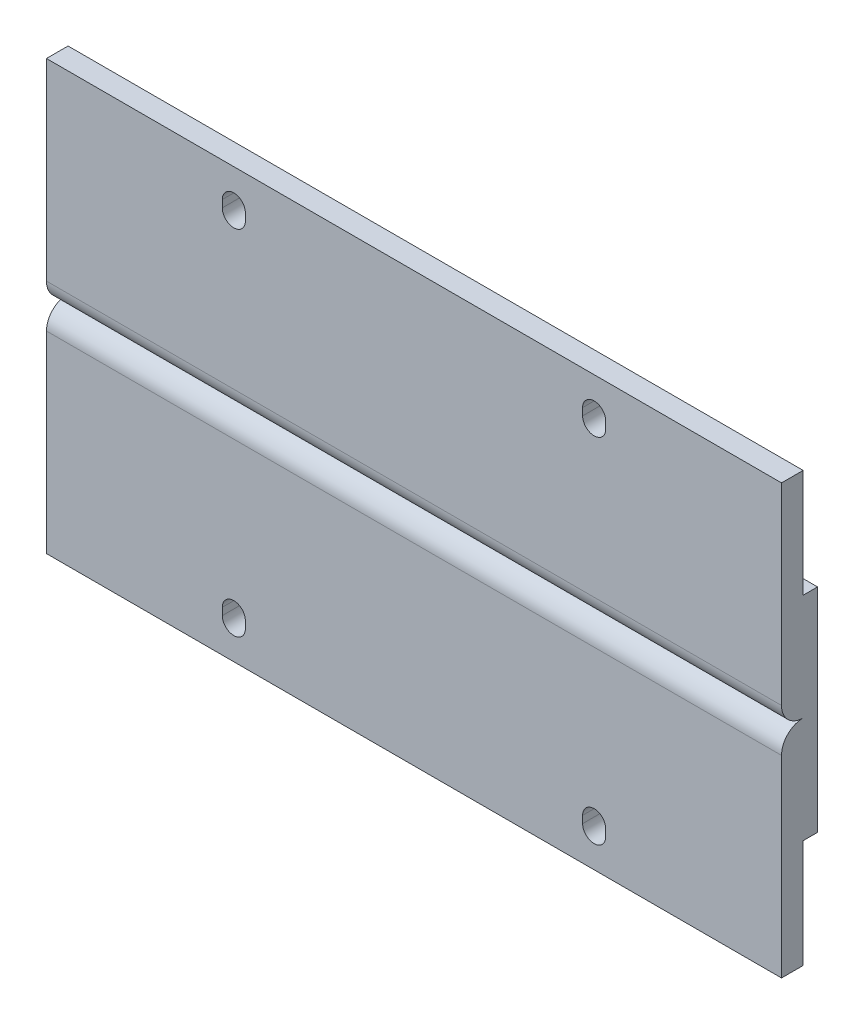
ISO-10303-21;
HEADER;
FILE_DESCRIPTION(('STEP AP214'),'2;1');
FILE_NAME('part.step','',(''),(''),'','','');
FILE_SCHEMA(('AUTOMOTIVE_DESIGN { 1 0 10303 214 1 1 1 1 }'));
ENDSEC;
DATA;
#1=APPLICATION_CONTEXT('core data for automotive mechanical design processes');
#2=APPLICATION_PROTOCOL_DEFINITION('international standard','automotive_design',2000,#1);
#3=PRODUCT_CONTEXT('',#1,'mechanical');
#4=PRODUCT('Part','Part','',(#3));
#5=PRODUCT_RELATED_PRODUCT_CATEGORY('part','',(#4));
#6=PRODUCT_DEFINITION_FORMATION('','',#4);
#7=PRODUCT_DEFINITION_CONTEXT('part definition',#1,'design');
#8=PRODUCT_DEFINITION('design','',#6,#7);
#9=PRODUCT_DEFINITION_SHAPE('','',#8);
#10=(LENGTH_UNIT() NAMED_UNIT(*) SI_UNIT(.MILLI.,.METRE.));
#11=(NAMED_UNIT(*) PLANE_ANGLE_UNIT() SI_UNIT($,.RADIAN.));
#12=(NAMED_UNIT(*) SI_UNIT($,.STERADIAN.) SOLID_ANGLE_UNIT());
#13=UNCERTAINTY_MEASURE_WITH_UNIT(LENGTH_MEASURE(1.E-05),#10,'distance_accuracy_value','');
#14=(GEOMETRIC_REPRESENTATION_CONTEXT(3) GLOBAL_UNCERTAINTY_ASSIGNED_CONTEXT((#13)) GLOBAL_UNIT_ASSIGNED_CONTEXT((#10,
#11,#12)) REPRESENTATION_CONTEXT('',''));
#15=CARTESIAN_POINT('',(0.,0.,0.));
#16=DIRECTION('',(0.,0.,1.));
#17=DIRECTION('',(1.,0.,0.));
#18=AXIS2_PLACEMENT_3D('',#15,#16,#17);
#19=CARTESIAN_POINT('',(51.,29.75,0.));
#20=DIRECTION('',(0.,0.,-1.));
#21=DIRECTION('',(-1.,0.,0.));
#22=AXIS2_PLACEMENT_3D('',#19,#20,#21);
#23=PLANE('',#22);
#24=DIRECTION('',(0.,1.,0.));
#25=VECTOR('',#24,1.);
#26=CARTESIAN_POINT('',(26.6,24.,0.));
#27=LINE('',#26,#25);
#28=CARTESIAN_POINT('',(26.6,24.,0.));
#29=VERTEX_POINT('',#28);
#30=CARTESIAN_POINT('',(26.6,25.,0.));
#31=VERTEX_POINT('',#30);
#32=EDGE_CURVE('E435',#29,#31,#27,.T.);
#33=ORIENTED_EDGE('',*,*,#32,.F.);
#34=CARTESIAN_POINT('',(25.,24.,0.));
#35=DIRECTION('',(0.,0.,1.));
#36=DIRECTION('',(1.,0.,0.));
#37=AXIS2_PLACEMENT_3D('',#34,#35,#36);
#38=CIRCLE('',#37,1.6);
#39=CARTESIAN_POINT('',(23.4,24.,0.));
#40=VERTEX_POINT('',#39);
#41=EDGE_CURVE('E432',#40,#29,#38,.T.);
#42=ORIENTED_EDGE('',*,*,#41,.F.);
#43=DIRECTION('',(0.,-1.,0.));
#44=VECTOR('',#43,1.);
#45=CARTESIAN_POINT('',(23.4,24.,0.));
#46=LINE('',#45,#44);
#47=CARTESIAN_POINT('',(23.4,25.,0.));
#48=VERTEX_POINT('',#47);
#49=EDGE_CURVE('E443',#48,#40,#46,.T.);
#50=ORIENTED_EDGE('',*,*,#49,.F.);
#51=CARTESIAN_POINT('',(25.,25.,0.));
#52=DIRECTION('',(0.,0.,1.));
#53=DIRECTION('',(1.,0.,0.));
#54=AXIS2_PLACEMENT_3D('',#51,#52,#53);
#55=CIRCLE('',#54,1.6);
#56=EDGE_CURVE('E439',#31,#48,#55,.T.);
#57=ORIENTED_EDGE('',*,*,#56,.F.);
#58=EDGE_LOOP('',(#33,#42,#50,#57));
#59=FACE_BOUND('',#58,.T.);
#60=DIRECTION('',(0.,1.,0.));
#61=VECTOR('',#60,1.);
#62=CARTESIAN_POINT('',(-23.4,24.,0.));
#63=LINE('',#62,#61);
#64=CARTESIAN_POINT('',(-23.4,24.,0.));
#65=VERTEX_POINT('',#64);
#66=CARTESIAN_POINT('',(-23.4,25.,0.));
#67=VERTEX_POINT('',#66);
#68=EDGE_CURVE('E544',#65,#67,#63,.T.);
#69=ORIENTED_EDGE('',*,*,#68,.F.);
#70=CARTESIAN_POINT('',(-25.,24.,0.));
#71=DIRECTION('',(0.,0.,1.));
#72=DIRECTION('',(1.,0.,0.));
#73=AXIS2_PLACEMENT_3D('',#70,#71,#72);
#74=CIRCLE('',#73,1.6);
#75=CARTESIAN_POINT('',(-26.6,24.,0.));
#76=VERTEX_POINT('',#75);
#77=EDGE_CURVE('E68',#76,#65,#74,.T.);
#78=ORIENTED_EDGE('',*,*,#77,.F.);
#79=DIRECTION('',(0.,-1.,0.));
#80=VECTOR('',#79,1.);
#81=CARTESIAN_POINT('',(-26.6,24.,0.));
#82=LINE('',#81,#80);
#83=CARTESIAN_POINT('',(-26.6,25.,0.));
#84=VERTEX_POINT('',#83);
#85=EDGE_CURVE('E528',#84,#76,#82,.T.);
#86=ORIENTED_EDGE('',*,*,#85,.F.);
#87=CARTESIAN_POINT('',(-25.,25.,0.));
#88=DIRECTION('',(0.,0.,1.));
#89=DIRECTION('',(1.,0.,0.));
#90=AXIS2_PLACEMENT_3D('',#87,#88,#89);
#91=CIRCLE('',#90,1.6);
#92=EDGE_CURVE('E540',#67,#84,#91,.T.);
#93=ORIENTED_EDGE('',*,*,#92,.F.);
#94=EDGE_LOOP('',(#69,#78,#86,#93));
#95=FACE_BOUND('',#94,.T.);
#96=DIRECTION('',(0.,-1.,0.));
#97=VECTOR('',#96,1.);
#98=CARTESIAN_POINT('',(-51.,29.75,0.));
#99=LINE('',#98,#97);
#100=CARTESIAN_POINT('',(-51.,29.75,0.));
#101=VERTEX_POINT('',#100);
#102=CARTESIAN_POINT('',(-51.,3.,0.));
#103=VERTEX_POINT('',#102);
#104=EDGE_CURVE('E284',#101,#103,#99,.T.);
#105=ORIENTED_EDGE('',*,*,#104,.T.);
#106=DIRECTION('',(1.,0.,0.));
#107=VECTOR('',#106,1.);
#108=CARTESIAN_POINT('',(-51.,3.,0.));
#109=LINE('',#108,#107);
#110=CARTESIAN_POINT('',(51.,3.,0.));
#111=VERTEX_POINT('',#110);
#112=EDGE_CURVE('E877',#103,#111,#109,.T.);
#113=ORIENTED_EDGE('',*,*,#112,.T.);
#114=DIRECTION('',(0.,-1.,0.));
#115=VECTOR('',#114,1.);
#116=CARTESIAN_POINT('',(51.,29.75,0.));
#117=LINE('',#116,#115);
#118=CARTESIAN_POINT('',(51.,29.75,0.));
#119=VERTEX_POINT('',#118);
#120=EDGE_CURVE('E249',#119,#111,#117,.T.);
#121=ORIENTED_EDGE('',*,*,#120,.F.);
#122=DIRECTION('',(-1.,0.,0.));
#123=VECTOR('',#122,1.);
#124=CARTESIAN_POINT('',(51.,29.75,0.));
#125=LINE('',#124,#123);
#126=EDGE_CURVE('E330',#119,#101,#125,.T.);
#127=ORIENTED_EDGE('',*,*,#126,.T.);
#128=EDGE_LOOP('',(#105,#113,#121,#127));
#129=FACE_BOUND('',#128,.T.);
#130=ADVANCED_FACE('F44',(#59,#95,#129),#23,.F.);
#131=CARTESIAN_POINT('',(51.,29.75,-2.99999999999998));
#132=DIRECTION('',(0.,-1.,0.));
#133=DIRECTION('',(0.,0.,-1.));
#134=AXIS2_PLACEMENT_3D('',#131,#132,#133);
#135=PLANE('',#134);
#136=DIRECTION('',(0.,0.,1.));
#137=VECTOR('',#136,1.);
#138=CARTESIAN_POINT('',(-51.,29.75,-2.99999999999998));
#139=LINE('',#138,#137);
#140=CARTESIAN_POINT('',(-51.,29.75,-2.99999999999998));
#141=VERTEX_POINT('',#140);
#142=EDGE_CURVE('E278',#141,#101,#139,.T.);
#143=ORIENTED_EDGE('',*,*,#142,.T.);
#144=ORIENTED_EDGE('',*,*,#126,.F.);
#145=DIRECTION('',(0.,0.,1.));
#146=VECTOR('',#145,1.);
#147=CARTESIAN_POINT('',(51.,29.75,-2.99999999999998));
#148=LINE('',#147,#146);
#149=CARTESIAN_POINT('',(51.,29.75,-2.99999999999998));
#150=VERTEX_POINT('',#149);
#151=EDGE_CURVE('E250',#150,#119,#148,.T.);
#152=ORIENTED_EDGE('',*,*,#151,.F.);
#153=DIRECTION('',(-1.,0.,0.));
#154=VECTOR('',#153,1.);
#155=CARTESIAN_POINT('',(51.,29.75,-2.99999999999998));
#156=LINE('',#155,#154);
#157=EDGE_CURVE('E277',#150,#141,#156,.T.);
#158=ORIENTED_EDGE('',*,*,#157,.T.);
#159=EDGE_LOOP('',(#143,#144,#152,#158));
#160=FACE_BOUND('',#159,.T.);
#161=ADVANCED_FACE('F46',(#160),#135,.F.);
#162=DIRECTION('',(0.,-1.,0.));
#163=VECTOR('',#162,1.);
#164=CARTESIAN_POINT('',(23.4,-24.,0.));
#165=LINE('',#164,#163);
#166=CARTESIAN_POINT('',(23.4,-24.,0.));
#167=VERTEX_POINT('',#166);
#168=CARTESIAN_POINT('',(23.4,-25.,0.));
#169=VERTEX_POINT('',#168);
#170=EDGE_CURVE('E424',#167,#169,#165,.T.);
#171=ORIENTED_EDGE('',*,*,#170,.F.);
#172=CARTESIAN_POINT('',(25.,-24.,0.));
#173=DIRECTION('',(0.,0.,1.));
#174=DIRECTION('',(1.,0.,0.));
#175=AXIS2_PLACEMENT_3D('',#172,#173,#174);
#176=CIRCLE('',#175,1.6);
#177=CARTESIAN_POINT('',(26.6,-24.,0.));
#178=VERTEX_POINT('',#177);
#179=EDGE_CURVE('E428',#178,#167,#176,.T.);
#180=ORIENTED_EDGE('',*,*,#179,.F.);
#181=DIRECTION('',(0.,1.,0.));
#182=VECTOR('',#181,1.);
#183=CARTESIAN_POINT('',(26.6,-24.,0.));
#184=LINE('',#183,#182);
#185=CARTESIAN_POINT('',(26.6,-25.,0.));
#186=VERTEX_POINT('',#185);
#187=EDGE_CURVE('E419',#186,#178,#184,.T.);
#188=ORIENTED_EDGE('',*,*,#187,.F.);
#189=CARTESIAN_POINT('',(25.,-25.,0.));
#190=DIRECTION('',(0.,0.,1.));
#191=DIRECTION('',(1.,0.,0.));
#192=AXIS2_PLACEMENT_3D('',#189,#190,#191);
#193=CIRCLE('',#192,1.59999999999999);
#194=EDGE_CURVE('E406',#169,#186,#193,.T.);
#195=ORIENTED_EDGE('',*,*,#194,.F.);
#196=EDGE_LOOP('',(#171,#180,#188,#195));
#197=FACE_BOUND('',#196,.T.);
#198=DIRECTION('',(0.,-1.,0.));
#199=VECTOR('',#198,1.);
#200=CARTESIAN_POINT('',(-26.6,-24.,0.));
#201=LINE('',#200,#199);
#202=CARTESIAN_POINT('',(-26.6,-24.,0.));
#203=VERTEX_POINT('',#202);
#204=CARTESIAN_POINT('',(-26.6,-25.,0.));
#205=VERTEX_POINT('',#204);
#206=EDGE_CURVE('E510',#203,#205,#201,.T.);
#207=ORIENTED_EDGE('',*,*,#206,.F.);
#208=CARTESIAN_POINT('',(-25.,-24.,0.));
#209=DIRECTION('',(0.,0.,1.));
#210=DIRECTION('',(1.,0.,0.));
#211=AXIS2_PLACEMENT_3D('',#208,#209,#210);
#212=CIRCLE('',#211,1.6);
#213=CARTESIAN_POINT('',(-23.4,-24.,0.));
#214=VERTEX_POINT('',#213);
#215=EDGE_CURVE('E415',#214,#203,#212,.T.);
#216=ORIENTED_EDGE('',*,*,#215,.F.);
#217=DIRECTION('',(0.,1.,0.));
#218=VECTOR('',#217,1.);
#219=CARTESIAN_POINT('',(-23.4,-24.,0.));
#220=LINE('',#219,#218);
#221=CARTESIAN_POINT('',(-23.4,-25.,0.));
#222=VERTEX_POINT('',#221);
#223=EDGE_CURVE('E521',#222,#214,#220,.T.);
#224=ORIENTED_EDGE('',*,*,#223,.F.);
#225=CARTESIAN_POINT('',(-25.,-25.,0.));
#226=DIRECTION('',(0.,0.,1.));
#227=DIRECTION('',(1.,0.,0.));
#228=AXIS2_PLACEMENT_3D('',#225,#226,#227);
#229=CIRCLE('',#228,1.59999999999999);
#230=EDGE_CURVE('E513',#205,#222,#229,.T.);
#231=ORIENTED_EDGE('',*,*,#230,.F.);
#232=EDGE_LOOP('',(#207,#216,#224,#231));
#233=FACE_BOUND('',#232,.T.);
#234=CARTESIAN_POINT('',(51.,-3.,0.));
#235=VERTEX_POINT('',#234);
#236=CARTESIAN_POINT('',(51.,-29.75,0.));
#237=VERTEX_POINT('',#236);
#238=EDGE_CURVE('E239',#235,#237,#117,.T.);
#239=ORIENTED_EDGE('',*,*,#238,.F.);
#240=DIRECTION('',(1.,0.,0.));
#241=VECTOR('',#240,1.);
#242=CARTESIAN_POINT('',(-51.,-3.,0.));
#243=LINE('',#242,#241);
#244=CARTESIAN_POINT('',(-51.,-3.,0.));
#245=VERTEX_POINT('',#244);
#246=EDGE_CURVE('E223',#245,#235,#243,.T.);
#247=ORIENTED_EDGE('',*,*,#246,.F.);
#248=CARTESIAN_POINT('',(-51.,-29.75,0.));
#249=VERTEX_POINT('',#248);
#250=EDGE_CURVE('E282',#245,#249,#99,.T.);
#251=ORIENTED_EDGE('',*,*,#250,.T.);
#252=DIRECTION('',(-1.,0.,0.));
#253=VECTOR('',#252,1.);
#254=CARTESIAN_POINT('',(51.,-29.75,0.));
#255=LINE('',#254,#253);
#256=EDGE_CURVE('E246',#237,#249,#255,.T.);
#257=ORIENTED_EDGE('',*,*,#256,.F.);
#258=EDGE_LOOP('',(#239,#247,#251,#257));
#259=FACE_BOUND('',#258,.T.);
#260=ADVANCED_FACE('F244',(#197,#233,#259),#23,.F.);
#261=CARTESIAN_POINT('',(51.,-29.75,0.));
#262=DIRECTION('',(0.,1.,0.));
#263=DIRECTION('',(0.,0.,1.));
#264=AXIS2_PLACEMENT_3D('',#261,#262,#263);
#265=PLANE('',#264);
#266=DIRECTION('',(0.,0.,-1.));
#267=VECTOR('',#266,1.);
#268=CARTESIAN_POINT('',(-51.,-29.75,0.));
#269=LINE('',#268,#267);
#270=CARTESIAN_POINT('',(-51.,-29.75,-2.99999999999998));
#271=VERTEX_POINT('',#270);
#272=EDGE_CURVE('E288',#249,#271,#269,.T.);
#273=ORIENTED_EDGE('',*,*,#272,.T.);
#274=DIRECTION('',(-1.,0.,0.));
#275=VECTOR('',#274,1.);
#276=CARTESIAN_POINT('',(51.,-29.75,-2.99999999999998));
#277=LINE('',#276,#275);
#278=CARTESIAN_POINT('',(51.,-29.75,-2.99999999999998));
#279=VERTEX_POINT('',#278);
#280=EDGE_CURVE('E324',#279,#271,#277,.T.);
#281=ORIENTED_EDGE('',*,*,#280,.F.);
#282=DIRECTION('',(0.,0.,-1.));
#283=VECTOR('',#282,1.);
#284=CARTESIAN_POINT('',(51.,-29.75,0.));
#285=LINE('',#284,#283);
#286=EDGE_CURVE('E254',#237,#279,#285,.T.);
#287=ORIENTED_EDGE('',*,*,#286,.F.);
#288=ORIENTED_EDGE('',*,*,#256,.T.);
#289=EDGE_LOOP('',(#273,#281,#287,#288));
#290=FACE_BOUND('',#289,.T.);
#291=ADVANCED_FACE('F496',(#290),#265,.F.);
#292=CARTESIAN_POINT('',(51.,-29.75,-2.99999999999998));
#293=DIRECTION('',(0.,0.,1.));
#294=DIRECTION('',(0.,-1.,0.));
#295=AXIS2_PLACEMENT_3D('',#292,#293,#294);
#296=PLANE('',#295);
#297=DIRECTION('',(0.,1.,0.));
#298=VECTOR('',#297,1.);
#299=CARTESIAN_POINT('',(26.6,-29.7499999999999,-2.99999999999998));
#300=LINE('',#299,#298);
#301=CARTESIAN_POINT('',(26.6,-25.,-2.99999999999999));
#302=VERTEX_POINT('',#301);
#303=CARTESIAN_POINT('',(26.6,-24.,-2.99999999999999));
#304=VERTEX_POINT('',#303);
#305=EDGE_CURVE('E53',#302,#304,#300,.T.);
#306=ORIENTED_EDGE('',*,*,#305,.T.);
#307=CARTESIAN_POINT('',(25.,-24.,-2.99999999999999));
#308=DIRECTION('',(0.,0.,1.));
#309=DIRECTION('',(0.,-1.,0.));
#310=AXIS2_PLACEMENT_3D('',#307,#308,#309);
#311=CIRCLE('',#310,1.6);
#312=CARTESIAN_POINT('',(23.4,-24.,-2.99999999999999));
#313=VERTEX_POINT('',#312);
#314=EDGE_CURVE('E11',#304,#313,#311,.T.);
#315=ORIENTED_EDGE('',*,*,#314,.T.);
#316=DIRECTION('',(0.,-1.,0.));
#317=VECTOR('',#316,1.);
#318=CARTESIAN_POINT('',(23.4,-29.7500000000001,-2.99999999999998));
#319=LINE('',#318,#317);
#320=CARTESIAN_POINT('',(23.4,-25.,-2.99999999999999));
#321=VERTEX_POINT('',#320);
#322=EDGE_CURVE('E382',#313,#321,#319,.T.);
#323=ORIENTED_EDGE('',*,*,#322,.T.);
#324=CARTESIAN_POINT('',(25.,-25.,-2.99999999999999));
#325=DIRECTION('',(0.,0.,1.));
#326=DIRECTION('',(0.,-1.,0.));
#327=AXIS2_PLACEMENT_3D('',#324,#325,#326);
#328=CIRCLE('',#327,1.59999999999999);
#329=EDGE_CURVE('E386',#321,#302,#328,.T.);
#330=ORIENTED_EDGE('',*,*,#329,.T.);
#331=EDGE_LOOP('',(#306,#315,#323,#330));
#332=FACE_BOUND('',#331,.T.);
#333=DIRECTION('',(0.,1.,0.));
#334=VECTOR('',#333,1.);
#335=CARTESIAN_POINT('',(-23.4,-29.7499999999997,-2.99999999999998));
#336=LINE('',#335,#334);
#337=CARTESIAN_POINT('',(-23.4,-25.,-2.99999999999999));
#338=VERTEX_POINT('',#337);
#339=CARTESIAN_POINT('',(-23.4,-24.,-2.99999999999999));
#340=VERTEX_POINT('',#339);
#341=EDGE_CURVE('E374',#338,#340,#336,.T.);
#342=ORIENTED_EDGE('',*,*,#341,.T.);
#343=CARTESIAN_POINT('',(-25.,-24.,-2.99999999999999));
#344=DIRECTION('',(0.,0.,1.));
#345=DIRECTION('',(0.,-1.,0.));
#346=AXIS2_PLACEMENT_3D('',#343,#344,#345);
#347=CIRCLE('',#346,1.6);
#348=CARTESIAN_POINT('',(-26.6,-24.,-2.99999999999999));
#349=VERTEX_POINT('',#348);
#350=EDGE_CURVE('E378',#340,#349,#347,.T.);
#351=ORIENTED_EDGE('',*,*,#350,.T.);
#352=DIRECTION('',(0.,-1.,0.));
#353=VECTOR('',#352,1.);
#354=CARTESIAN_POINT('',(-26.6,-29.7500000000003,-2.99999999999998));
#355=LINE('',#354,#353);
#356=CARTESIAN_POINT('',(-26.6,-25.,-2.99999999999999));
#357=VERTEX_POINT('',#356);
#358=EDGE_CURVE('E366',#349,#357,#355,.T.);
#359=ORIENTED_EDGE('',*,*,#358,.T.);
#360=CARTESIAN_POINT('',(-25.,-25.,-2.99999999999999));
#361=DIRECTION('',(0.,0.,1.));
#362=DIRECTION('',(0.,-1.,0.));
#363=AXIS2_PLACEMENT_3D('',#360,#361,#362);
#364=CIRCLE('',#363,1.59999999999999);
#365=EDGE_CURVE('E370',#357,#338,#364,.T.);
#366=ORIENTED_EDGE('',*,*,#365,.T.);
#367=EDGE_LOOP('',(#342,#351,#359,#366));
#368=FACE_BOUND('',#367,.T.);
#369=DIRECTION('',(0.,1.,0.));
#370=VECTOR('',#369,1.);
#371=CARTESIAN_POINT('',(-51.,-29.75,-2.99999999999998));
#372=LINE('',#371,#370);
#373=CARTESIAN_POINT('',(-51.,-14.75,-3.00000000000001));
#374=VERTEX_POINT('',#373);
#375=EDGE_CURVE('E291',#271,#374,#372,.T.);
#376=ORIENTED_EDGE('',*,*,#375,.T.);
#377=DIRECTION('',(-1.,0.,0.));
#378=VECTOR('',#377,1.);
#379=CARTESIAN_POINT('',(51.,-14.75,-3.00000000000001));
#380=LINE('',#379,#378);
#381=CARTESIAN_POINT('',(51.,-14.75,-3.00000000000001));
#382=VERTEX_POINT('',#381);
#383=EDGE_CURVE('E320',#382,#374,#380,.T.);
#384=ORIENTED_EDGE('',*,*,#383,.F.);
#385=DIRECTION('',(0.,1.,0.));
#386=VECTOR('',#385,1.);
#387=CARTESIAN_POINT('',(51.,-29.75,-2.99999999999998));
#388=LINE('',#387,#386);
#389=EDGE_CURVE('E262',#279,#382,#388,.T.);
#390=ORIENTED_EDGE('',*,*,#389,.F.);
#391=ORIENTED_EDGE('',*,*,#280,.T.);
#392=EDGE_LOOP('',(#376,#384,#390,#391));
#393=FACE_BOUND('',#392,.T.);
#394=ADVANCED_FACE('F392',(#332,#368,#393),#296,.F.);
#395=CARTESIAN_POINT('',(51.,-14.75,-3.00000000000001));
#396=DIRECTION('',(0.,1.,0.));
#397=DIRECTION('',(0.,0.,1.));
#398=AXIS2_PLACEMENT_3D('',#395,#396,#397);
#399=PLANE('',#398);
#400=DIRECTION('',(0.,0.,-1.));
#401=VECTOR('',#400,1.);
#402=CARTESIAN_POINT('',(-51.,-14.75,-3.00000000000001));
#403=LINE('',#402,#401);
#404=CARTESIAN_POINT('',(-51.,-14.75,-5.00000000000001));
#405=VERTEX_POINT('',#404);
#406=EDGE_CURVE('E294',#374,#405,#403,.T.);
#407=ORIENTED_EDGE('',*,*,#406,.T.);
#408=DIRECTION('',(-1.,0.,0.));
#409=VECTOR('',#408,1.);
#410=CARTESIAN_POINT('',(51.,-14.75,-5.00000000000001));
#411=LINE('',#410,#409);
#412=CARTESIAN_POINT('',(51.,-14.75,-5.00000000000001));
#413=VERTEX_POINT('',#412);
#414=EDGE_CURVE('E316',#413,#405,#411,.T.);
#415=ORIENTED_EDGE('',*,*,#414,.F.);
#416=DIRECTION('',(0.,0.,-1.));
#417=VECTOR('',#416,1.);
#418=CARTESIAN_POINT('',(51.,-14.75,-3.00000000000001));
#419=LINE('',#418,#417);
#420=EDGE_CURVE('E265',#382,#413,#419,.T.);
#421=ORIENTED_EDGE('',*,*,#420,.F.);
#422=ORIENTED_EDGE('',*,*,#383,.T.);
#423=EDGE_LOOP('',(#407,#415,#421,#422));
#424=FACE_BOUND('',#423,.T.);
#425=ADVANCED_FACE('F764',(#424),#399,.F.);
#426=CARTESIAN_POINT('',(51.,-14.75,-5.00000000000001));
#427=DIRECTION('',(0.,0.,1.));
#428=DIRECTION('',(0.,-1.,0.));
#429=AXIS2_PLACEMENT_3D('',#426,#427,#428);
#430=PLANE('',#429);
#431=DIRECTION('',(0.,1.,0.));
#432=VECTOR('',#431,1.);
#433=CARTESIAN_POINT('',(-51.,-14.75,-5.00000000000001));
#434=LINE('',#433,#432);
#435=CARTESIAN_POINT('',(-51.,14.75,-5.));
#436=VERTEX_POINT('',#435);
#437=EDGE_CURVE('E297',#405,#436,#434,.T.);
#438=ORIENTED_EDGE('',*,*,#437,.T.);
#439=DIRECTION('',(-1.,0.,0.));
#440=VECTOR('',#439,1.);
#441=CARTESIAN_POINT('',(51.,14.75,-5.));
#442=LINE('',#441,#440);
#443=CARTESIAN_POINT('',(51.,14.75,-5.));
#444=VERTEX_POINT('',#443);
#445=EDGE_CURVE('E312',#444,#436,#442,.T.);
#446=ORIENTED_EDGE('',*,*,#445,.F.);
#447=DIRECTION('',(0.,1.,0.));
#448=VECTOR('',#447,1.);
#449=CARTESIAN_POINT('',(51.,-14.75,-5.00000000000001));
#450=LINE('',#449,#448);
#451=EDGE_CURVE('E268',#413,#444,#450,.T.);
#452=ORIENTED_EDGE('',*,*,#451,.F.);
#453=ORIENTED_EDGE('',*,*,#414,.T.);
#454=EDGE_LOOP('',(#438,#446,#452,#453));
#455=FACE_BOUND('',#454,.T.);
#456=ADVANCED_FACE('F754',(#455),#430,.F.);
#457=CARTESIAN_POINT('',(51.,14.75,-5.));
#458=DIRECTION('',(0.,-1.,0.));
#459=DIRECTION('',(0.,0.,-1.));
#460=AXIS2_PLACEMENT_3D('',#457,#458,#459);
#461=PLANE('',#460);
#462=DIRECTION('',(0.,0.,1.));
#463=VECTOR('',#462,1.);
#464=CARTESIAN_POINT('',(-51.,14.75,-5.));
#465=LINE('',#464,#463);
#466=CARTESIAN_POINT('',(-51.,14.75,-3.00000000000001));
#467=VERTEX_POINT('',#466);
#468=EDGE_CURVE('E300',#436,#467,#465,.T.);
#469=ORIENTED_EDGE('',*,*,#468,.T.);
#470=DIRECTION('',(-1.,0.,0.));
#471=VECTOR('',#470,1.);
#472=CARTESIAN_POINT('',(51.,14.75,-3.00000000000001));
#473=LINE('',#472,#471);
#474=CARTESIAN_POINT('',(51.,14.75,-3.00000000000001));
#475=VERTEX_POINT('',#474);
#476=EDGE_CURVE('E308',#475,#467,#473,.T.);
#477=ORIENTED_EDGE('',*,*,#476,.F.);
#478=DIRECTION('',(0.,0.,1.));
#479=VECTOR('',#478,1.);
#480=CARTESIAN_POINT('',(51.,14.75,-5.));
#481=LINE('',#480,#479);
#482=EDGE_CURVE('E271',#444,#475,#481,.T.);
#483=ORIENTED_EDGE('',*,*,#482,.F.);
#484=ORIENTED_EDGE('',*,*,#445,.T.);
#485=EDGE_LOOP('',(#469,#477,#483,#484));
#486=FACE_BOUND('',#485,.T.);
#487=ADVANCED_FACE('F744',(#486),#461,.F.);
#488=CARTESIAN_POINT('',(51.,14.75,-3.00000000000001));
#489=DIRECTION('',(0.,0.,1.));
#490=DIRECTION('',(0.,-1.,0.));
#491=AXIS2_PLACEMENT_3D('',#488,#489,#490);
#492=PLANE('',#491);
#493=DIRECTION('',(0.,-1.,0.));
#494=VECTOR('',#493,1.);
#495=CARTESIAN_POINT('',(-26.6,14.75,-3.00000000000001));
#496=LINE('',#495,#494);
#497=CARTESIAN_POINT('',(-26.6,25.,-2.99999999999999));
#498=VERTEX_POINT('',#497);
#499=CARTESIAN_POINT('',(-26.6,24.,-2.99999999999999));
#500=VERTEX_POINT('',#499);
#501=EDGE_CURVE('E358',#498,#500,#496,.T.);
#502=ORIENTED_EDGE('',*,*,#501,.T.);
#503=CARTESIAN_POINT('',(-25.,24.,-2.99999999999999));
#504=DIRECTION('',(0.,0.,1.));
#505=DIRECTION('',(0.,-1.,0.));
#506=AXIS2_PLACEMENT_3D('',#503,#504,#505);
#507=CIRCLE('',#506,1.6);
#508=CARTESIAN_POINT('',(-23.4,24.,-2.99999999999999));
#509=VERTEX_POINT('',#508);
#510=EDGE_CURVE('E362',#500,#509,#507,.T.);
#511=ORIENTED_EDGE('',*,*,#510,.T.);
#512=DIRECTION('',(0.,1.,0.));
#513=VECTOR('',#512,1.);
#514=CARTESIAN_POINT('',(-23.4,14.75,-3.00000000000001));
#515=LINE('',#514,#513);
#516=CARTESIAN_POINT('',(-23.4,25.,-2.99999999999999));
#517=VERTEX_POINT('',#516);
#518=EDGE_CURVE('E350',#509,#517,#515,.T.);
#519=ORIENTED_EDGE('',*,*,#518,.T.);
#520=CARTESIAN_POINT('',(-25.,25.,-2.99999999999999));
#521=DIRECTION('',(0.,0.,1.));
#522=DIRECTION('',(0.,-1.,0.));
#523=AXIS2_PLACEMENT_3D('',#520,#521,#522);
#524=CIRCLE('',#523,1.6);
#525=EDGE_CURVE('E354',#517,#498,#524,.T.);
#526=ORIENTED_EDGE('',*,*,#525,.T.);
#527=EDGE_LOOP('',(#502,#511,#519,#526));
#528=FACE_BOUND('',#527,.T.);
#529=DIRECTION('',(0.,-1.,0.));
#530=VECTOR('',#529,1.);
#531=CARTESIAN_POINT('',(23.4,14.75,-3.00000000000001));
#532=LINE('',#531,#530);
#533=CARTESIAN_POINT('',(23.4,25.,-2.99999999999999));
#534=VERTEX_POINT('',#533);
#535=CARTESIAN_POINT('',(23.4,24.,-2.99999999999999));
#536=VERTEX_POINT('',#535);
#537=EDGE_CURVE('E342',#534,#536,#532,.T.);
#538=ORIENTED_EDGE('',*,*,#537,.T.);
#539=CARTESIAN_POINT('',(25.,24.,-2.99999999999999));
#540=DIRECTION('',(0.,0.,1.));
#541=DIRECTION('',(0.,-1.,0.));
#542=AXIS2_PLACEMENT_3D('',#539,#540,#541);
#543=CIRCLE('',#542,1.6);
#544=CARTESIAN_POINT('',(26.6,24.,-2.99999999999999));
#545=VERTEX_POINT('',#544);
#546=EDGE_CURVE('E346',#536,#545,#543,.T.);
#547=ORIENTED_EDGE('',*,*,#546,.T.);
#548=DIRECTION('',(0.,1.,0.));
#549=VECTOR('',#548,1.);
#550=CARTESIAN_POINT('',(26.6,14.75,-3.00000000000001));
#551=LINE('',#550,#549);
#552=CARTESIAN_POINT('',(26.6,25.,-2.99999999999999));
#553=VERTEX_POINT('',#552);
#554=EDGE_CURVE('E334',#545,#553,#551,.T.);
#555=ORIENTED_EDGE('',*,*,#554,.T.);
#556=CARTESIAN_POINT('',(25.,25.,-2.99999999999999));
#557=DIRECTION('',(0.,0.,1.));
#558=DIRECTION('',(0.,-1.,0.));
#559=AXIS2_PLACEMENT_3D('',#556,#557,#558);
#560=CIRCLE('',#559,1.6);
#561=EDGE_CURVE('E338',#553,#534,#560,.T.);
#562=ORIENTED_EDGE('',*,*,#561,.T.);
#563=EDGE_LOOP('',(#538,#547,#555,#562));
#564=FACE_BOUND('',#563,.T.);
#565=DIRECTION('',(0.,1.,0.));
#566=VECTOR('',#565,1.);
#567=CARTESIAN_POINT('',(-51.,14.75,-3.00000000000001));
#568=LINE('',#567,#566);
#569=EDGE_CURVE('E256',#467,#141,#568,.T.);
#570=ORIENTED_EDGE('',*,*,#569,.T.);
#571=ORIENTED_EDGE('',*,*,#157,.F.);
#572=DIRECTION('',(0.,1.,0.));
#573=VECTOR('',#572,1.);
#574=CARTESIAN_POINT('',(51.,14.75,-3.00000000000001));
#575=LINE('',#574,#573);
#576=EDGE_CURVE('E274',#475,#150,#575,.T.);
#577=ORIENTED_EDGE('',*,*,#576,.F.);
#578=ORIENTED_EDGE('',*,*,#476,.T.);
#579=EDGE_LOOP('',(#570,#571,#577,#578));
#580=FACE_BOUND('',#579,.T.);
#581=ADVANCED_FACE('F472',(#528,#564,#580),#492,.F.);
#582=CARTESIAN_POINT('',(51.,0.,0.));
#583=DIRECTION('',(1.,0.,0.));
#584=DIRECTION('',(0.,0.,-1.));
#585=AXIS2_PLACEMENT_3D('',#582,#583,#584);
#586=PLANE('',#585);
#587=ORIENTED_EDGE('',*,*,#120,.T.);
#588=CARTESIAN_POINT('',(51.,3.,-3.));
#589=DIRECTION('',(1.,0.,0.));
#590=DIRECTION('',(0.,0.,-1.));
#591=AXIS2_PLACEMENT_3D('',#588,#589,#590);
#592=CIRCLE('',#591,3.);
#593=CARTESIAN_POINT('',(51.,0.,-3.));
#594=VERTEX_POINT('',#593);
#595=EDGE_CURVE('E241',#111,#594,#592,.T.);
#596=ORIENTED_EDGE('',*,*,#595,.T.);
#597=CARTESIAN_POINT('',(51.,-3.,-3.));
#598=DIRECTION('',(1.,0.,0.));
#599=DIRECTION('',(0.,0.,-1.));
#600=AXIS2_PLACEMENT_3D('',#597,#598,#599);
#601=CIRCLE('',#600,3.);
#602=EDGE_CURVE('E226',#235,#594,#601,.F.);
#603=ORIENTED_EDGE('',*,*,#602,.F.);
#604=ORIENTED_EDGE('',*,*,#238,.T.);
#605=ORIENTED_EDGE('',*,*,#286,.T.);
#606=ORIENTED_EDGE('',*,*,#389,.T.);
#607=ORIENTED_EDGE('',*,*,#420,.T.);
#608=ORIENTED_EDGE('',*,*,#451,.T.);
#609=ORIENTED_EDGE('',*,*,#482,.T.);
#610=ORIENTED_EDGE('',*,*,#576,.T.);
#611=ORIENTED_EDGE('',*,*,#151,.T.);
#612=EDGE_LOOP('',(#587,#596,#603,#604,#605,#606,#607,#608,#609,#610,#611));
#613=FACE_BOUND('',#612,.T.);
#614=ADVANCED_FACE('F238',(#613),#586,.T.);
#615=CARTESIAN_POINT('',(-51.,0.,0.));
#616=DIRECTION('',(1.,0.,0.));
#617=DIRECTION('',(0.,0.,-1.));
#618=AXIS2_PLACEMENT_3D('',#615,#616,#617);
#619=PLANE('',#618);
#620=CARTESIAN_POINT('',(-51.,3.,-3.));
#621=DIRECTION('',(1.,0.,0.));
#622=DIRECTION('',(0.,0.,-1.));
#623=AXIS2_PLACEMENT_3D('',#620,#621,#622);
#624=CIRCLE('',#623,3.);
#625=CARTESIAN_POINT('',(-51.,0.,-3.));
#626=VERTEX_POINT('',#625);
#627=EDGE_CURVE('E234',#103,#626,#624,.T.);
#628=ORIENTED_EDGE('',*,*,#627,.F.);
#629=ORIENTED_EDGE('',*,*,#104,.F.);
#630=ORIENTED_EDGE('',*,*,#142,.F.);
#631=ORIENTED_EDGE('',*,*,#569,.F.);
#632=ORIENTED_EDGE('',*,*,#468,.F.);
#633=ORIENTED_EDGE('',*,*,#437,.F.);
#634=ORIENTED_EDGE('',*,*,#406,.F.);
#635=ORIENTED_EDGE('',*,*,#375,.F.);
#636=ORIENTED_EDGE('',*,*,#272,.F.);
#637=ORIENTED_EDGE('',*,*,#250,.F.);
#638=CARTESIAN_POINT('',(-51.,-3.,-3.));
#639=DIRECTION('',(1.,0.,0.));
#640=DIRECTION('',(0.,0.,-1.));
#641=AXIS2_PLACEMENT_3D('',#638,#639,#640);
#642=CIRCLE('',#641,3.);
#643=EDGE_CURVE('E229',#245,#626,#642,.F.);
#644=ORIENTED_EDGE('',*,*,#643,.T.);
#645=EDGE_LOOP('',(#628,#629,#630,#631,#632,#633,#634,#635,#636,#637,#644));
#646=FACE_BOUND('',#645,.T.);
#647=ADVANCED_FACE('F485',(#646),#619,.F.);
#648=CARTESIAN_POINT('',(25.,24.,-5.00000000000001));
#649=DIRECTION('',(0.,0.,1.));
#650=DIRECTION('',(1.,0.,0.));
#651=AXIS2_PLACEMENT_3D('',#648,#649,#650);
#652=CYLINDRICAL_SURFACE('',#651,1.6);
#653=DIRECTION('',(0.,0.,1.));
#654=VECTOR('',#653,1.);
#655=CARTESIAN_POINT('',(23.4,24.,-5.00000000000001));
#656=LINE('',#655,#654);
#657=EDGE_CURVE('E283',#536,#40,#656,.T.);
#658=ORIENTED_EDGE('',*,*,#657,.T.);
#659=ORIENTED_EDGE('',*,*,#41,.T.);
#660=DIRECTION('',(0.,0.,1.));
#661=VECTOR('',#660,1.);
#662=CARTESIAN_POINT('',(26.6,24.,-5.00000000000001));
#663=LINE('',#662,#661);
#664=EDGE_CURVE('E447',#545,#29,#663,.T.);
#665=ORIENTED_EDGE('',*,*,#664,.F.);
#666=ORIENTED_EDGE('',*,*,#546,.F.);
#667=EDGE_LOOP('',(#658,#659,#665,#666));
#668=FACE_BOUND('',#667,.T.);
#669=ADVANCED_FACE('F475',(#668),#652,.F.);
#670=CARTESIAN_POINT('',(23.4,24.,-5.00000000000001));
#671=DIRECTION('',(-1.,0.,0.));
#672=DIRECTION('',(0.,0.,1.));
#673=AXIS2_PLACEMENT_3D('',#670,#671,#672);
#674=PLANE('',#673);
#675=DIRECTION('',(0.,0.,1.));
#676=VECTOR('',#675,1.);
#677=CARTESIAN_POINT('',(23.4,25.,-5.00000000000001));
#678=LINE('',#677,#676);
#679=EDGE_CURVE('E450',#534,#48,#678,.T.);
#680=ORIENTED_EDGE('',*,*,#679,.T.);
#681=ORIENTED_EDGE('',*,*,#49,.T.);
#682=ORIENTED_EDGE('',*,*,#657,.F.);
#683=ORIENTED_EDGE('',*,*,#537,.F.);
#684=EDGE_LOOP('',(#680,#681,#682,#683));
#685=FACE_BOUND('',#684,.T.);
#686=ADVANCED_FACE('F477',(#685),#674,.F.);
#687=CARTESIAN_POINT('',(25.,25.,-5.00000000000001));
#688=DIRECTION('',(0.,0.,1.));
#689=DIRECTION('',(1.,0.,0.));
#690=AXIS2_PLACEMENT_3D('',#687,#688,#689);
#691=CYLINDRICAL_SURFACE('',#690,1.6);
#692=DIRECTION('',(0.,0.,1.));
#693=VECTOR('',#692,1.);
#694=CARTESIAN_POINT('',(26.6,25.,-5.00000000000001));
#695=LINE('',#694,#693);
#696=EDGE_CURVE('E453',#553,#31,#695,.T.);
#697=ORIENTED_EDGE('',*,*,#696,.T.);
#698=ORIENTED_EDGE('',*,*,#56,.T.);
#699=ORIENTED_EDGE('',*,*,#679,.F.);
#700=ORIENTED_EDGE('',*,*,#561,.F.);
#701=EDGE_LOOP('',(#697,#698,#699,#700));
#702=FACE_BOUND('',#701,.T.);
#703=ADVANCED_FACE('F469',(#702),#691,.F.);
#704=CARTESIAN_POINT('',(26.6,24.,-5.00000000000001));
#705=DIRECTION('',(1.,0.,0.));
#706=DIRECTION('',(0.,0.,-1.));
#707=AXIS2_PLACEMENT_3D('',#704,#705,#706);
#708=PLANE('',#707);
#709=ORIENTED_EDGE('',*,*,#664,.T.);
#710=ORIENTED_EDGE('',*,*,#32,.T.);
#711=ORIENTED_EDGE('',*,*,#696,.F.);
#712=ORIENTED_EDGE('',*,*,#554,.F.);
#713=EDGE_LOOP('',(#709,#710,#711,#712));
#714=FACE_BOUND('',#713,.T.);
#715=ADVANCED_FACE('F460',(#714),#708,.F.);
#716=CARTESIAN_POINT('',(-25.,24.,-5.00000000000001));
#717=DIRECTION('',(0.,0.,1.));
#718=DIRECTION('',(1.,0.,0.));
#719=AXIS2_PLACEMENT_3D('',#716,#717,#718);
#720=CYLINDRICAL_SURFACE('',#719,1.6);
#721=DIRECTION('',(0.,0.,1.));
#722=VECTOR('',#721,1.);
#723=CARTESIAN_POINT('',(-26.6,24.,-5.00000000000001));
#724=LINE('',#723,#722);
#725=EDGE_CURVE('E431',#500,#76,#724,.T.);
#726=ORIENTED_EDGE('',*,*,#725,.T.);
#727=ORIENTED_EDGE('',*,*,#77,.T.);
#728=DIRECTION('',(0.,0.,1.));
#729=VECTOR('',#728,1.);
#730=CARTESIAN_POINT('',(-23.4,24.,-5.00000000000001));
#731=LINE('',#730,#729);
#732=EDGE_CURVE('E525',#509,#65,#731,.T.);
#733=ORIENTED_EDGE('',*,*,#732,.F.);
#734=ORIENTED_EDGE('',*,*,#510,.F.);
#735=EDGE_LOOP('',(#726,#727,#733,#734));
#736=FACE_BOUND('',#735,.T.);
#737=ADVANCED_FACE('F687',(#736),#720,.F.);
#738=CARTESIAN_POINT('',(-26.6,24.,-5.00000000000001));
#739=DIRECTION('',(-1.,0.,0.));
#740=DIRECTION('',(0.,0.,1.));
#741=AXIS2_PLACEMENT_3D('',#738,#739,#740);
#742=PLANE('',#741);
#743=DIRECTION('',(0.,0.,1.));
#744=VECTOR('',#743,1.);
#745=CARTESIAN_POINT('',(-26.6,25.,-5.00000000000001));
#746=LINE('',#745,#744);
#747=EDGE_CURVE('E532',#498,#84,#746,.T.);
#748=ORIENTED_EDGE('',*,*,#747,.T.);
#749=ORIENTED_EDGE('',*,*,#85,.T.);
#750=ORIENTED_EDGE('',*,*,#725,.F.);
#751=ORIENTED_EDGE('',*,*,#501,.F.);
#752=EDGE_LOOP('',(#748,#749,#750,#751));
#753=FACE_BOUND('',#752,.T.);
#754=ADVANCED_FACE('F567',(#753),#742,.F.);
#755=CARTESIAN_POINT('',(-25.,25.,-5.00000000000001));
#756=DIRECTION('',(0.,0.,1.));
#757=DIRECTION('',(1.,0.,0.));
#758=AXIS2_PLACEMENT_3D('',#755,#756,#757);
#759=CYLINDRICAL_SURFACE('',#758,1.6);
#760=DIRECTION('',(0.,0.,1.));
#761=VECTOR('',#760,1.);
#762=CARTESIAN_POINT('',(-23.4,25.,-5.00000000000001));
#763=LINE('',#762,#761);
#764=EDGE_CURVE('E529',#517,#67,#763,.T.);
#765=ORIENTED_EDGE('',*,*,#764,.T.);
#766=ORIENTED_EDGE('',*,*,#92,.T.);
#767=ORIENTED_EDGE('',*,*,#747,.F.);
#768=ORIENTED_EDGE('',*,*,#525,.F.);
#769=EDGE_LOOP('',(#765,#766,#767,#768));
#770=FACE_BOUND('',#769,.T.);
#771=ADVANCED_FACE('F669',(#770),#759,.F.);
#772=CARTESIAN_POINT('',(-23.4,24.,-5.00000000000001));
#773=DIRECTION('',(1.,0.,0.));
#774=DIRECTION('',(0.,0.,-1.));
#775=AXIS2_PLACEMENT_3D('',#772,#773,#774);
#776=PLANE('',#775);
#777=ORIENTED_EDGE('',*,*,#732,.T.);
#778=ORIENTED_EDGE('',*,*,#68,.T.);
#779=ORIENTED_EDGE('',*,*,#764,.F.);
#780=ORIENTED_EDGE('',*,*,#518,.F.);
#781=EDGE_LOOP('',(#777,#778,#779,#780));
#782=FACE_BOUND('',#781,.T.);
#783=ADVANCED_FACE('F659',(#782),#776,.F.);
#784=CARTESIAN_POINT('',(-25.,-24.,-5.00000000000001));
#785=DIRECTION('',(0.,0.,1.));
#786=DIRECTION('',(1.,0.,0.));
#787=AXIS2_PLACEMENT_3D('',#784,#785,#786);
#788=CYLINDRICAL_SURFACE('',#787,1.6);
#789=DIRECTION('',(0.,0.,1.));
#790=VECTOR('',#789,1.);
#791=CARTESIAN_POINT('',(-23.4,-24.,-5.00000000000001));
#792=LINE('',#791,#790);
#793=EDGE_CURVE('E881',#340,#214,#792,.T.);
#794=ORIENTED_EDGE('',*,*,#793,.T.);
#795=ORIENTED_EDGE('',*,*,#215,.T.);
#796=DIRECTION('',(0.,0.,1.));
#797=VECTOR('',#796,1.);
#798=CARTESIAN_POINT('',(-26.6,-24.,-5.00000000000001));
#799=LINE('',#798,#797);
#800=EDGE_CURVE('E884',#349,#203,#799,.T.);
#801=ORIENTED_EDGE('',*,*,#800,.F.);
#802=ORIENTED_EDGE('',*,*,#350,.F.);
#803=EDGE_LOOP('',(#794,#795,#801,#802));
#804=FACE_BOUND('',#803,.T.);
#805=ADVANCED_FACE('F649',(#804),#788,.F.);
#806=CARTESIAN_POINT('',(-23.4,-24.,-5.00000000000001));
#807=DIRECTION('',(1.,0.,0.));
#808=DIRECTION('',(0.,1.,0.));
#809=AXIS2_PLACEMENT_3D('',#806,#807,#808);
#810=PLANE('',#809);
#811=DIRECTION('',(0.,0.,1.));
#812=VECTOR('',#811,1.);
#813=CARTESIAN_POINT('',(-23.4,-25.,-5.00000000000001));
#814=LINE('',#813,#812);
#815=EDGE_CURVE('E890',#338,#222,#814,.T.);
#816=ORIENTED_EDGE('',*,*,#815,.T.);
#817=ORIENTED_EDGE('',*,*,#223,.T.);
#818=ORIENTED_EDGE('',*,*,#793,.F.);
#819=ORIENTED_EDGE('',*,*,#341,.F.);
#820=EDGE_LOOP('',(#816,#817,#818,#819));
#821=FACE_BOUND('',#820,.T.);
#822=ADVANCED_FACE('F639',(#821),#810,.F.);
#823=CARTESIAN_POINT('',(-25.,-25.,-5.00000000000001));
#824=DIRECTION('',(0.,0.,1.));
#825=DIRECTION('',(1.,0.,0.));
#826=AXIS2_PLACEMENT_3D('',#823,#824,#825);
#827=CYLINDRICAL_SURFACE('',#826,1.59999999999999);
#828=DIRECTION('',(0.,0.,1.));
#829=VECTOR('',#828,1.);
#830=CARTESIAN_POINT('',(-26.6,-25.,-5.00000000000001));
#831=LINE('',#830,#829);
#832=EDGE_CURVE('E887',#357,#205,#831,.T.);
#833=ORIENTED_EDGE('',*,*,#832,.T.);
#834=ORIENTED_EDGE('',*,*,#230,.T.);
#835=ORIENTED_EDGE('',*,*,#815,.F.);
#836=ORIENTED_EDGE('',*,*,#365,.F.);
#837=EDGE_LOOP('',(#833,#834,#835,#836));
#838=FACE_BOUND('',#837,.T.);
#839=ADVANCED_FACE('F563',(#838),#827,.F.);
#840=CARTESIAN_POINT('',(-26.6,-24.,-5.00000000000001));
#841=DIRECTION('',(-1.,0.,0.));
#842=DIRECTION('',(0.,-1.,0.));
#843=AXIS2_PLACEMENT_3D('',#840,#841,#842);
#844=PLANE('',#843);
#845=ORIENTED_EDGE('',*,*,#800,.T.);
#846=ORIENTED_EDGE('',*,*,#206,.T.);
#847=ORIENTED_EDGE('',*,*,#832,.F.);
#848=ORIENTED_EDGE('',*,*,#358,.F.);
#849=EDGE_LOOP('',(#845,#846,#847,#848));
#850=FACE_BOUND('',#849,.T.);
#851=ADVANCED_FACE('F557',(#850),#844,.F.);
#852=CARTESIAN_POINT('',(25.,-24.,-5.00000000000001));
#853=DIRECTION('',(0.,0.,1.));
#854=DIRECTION('',(1.,0.,0.));
#855=AXIS2_PLACEMENT_3D('',#852,#853,#854);
#856=CYLINDRICAL_SURFACE('',#855,1.6);
#857=DIRECTION('',(0.,0.,1.));
#858=VECTOR('',#857,1.);
#859=CARTESIAN_POINT('',(26.6,-24.,-5.00000000000001));
#860=LINE('',#859,#858);
#861=EDGE_CURVE('E402',#304,#178,#860,.T.);
#862=ORIENTED_EDGE('',*,*,#861,.T.);
#863=ORIENTED_EDGE('',*,*,#179,.T.);
#864=DIRECTION('',(0.,0.,1.));
#865=VECTOR('',#864,1.);
#866=CARTESIAN_POINT('',(23.4,-24.,-5.00000000000001));
#867=LINE('',#866,#865);
#868=EDGE_CURVE('E413',#313,#167,#867,.T.);
#869=ORIENTED_EDGE('',*,*,#868,.F.);
#870=ORIENTED_EDGE('',*,*,#314,.F.);
#871=EDGE_LOOP('',(#862,#863,#869,#870));
#872=FACE_BOUND('',#871,.T.);
#873=ADVANCED_FACE('F555',(#872),#856,.F.);
#874=CARTESIAN_POINT('',(26.6,-24.,-5.00000000000001));
#875=DIRECTION('',(1.,0.,0.));
#876=DIRECTION('',(0.,1.,0.));
#877=AXIS2_PLACEMENT_3D('',#874,#875,#876);
#878=PLANE('',#877);
#879=DIRECTION('',(0.,0.,1.));
#880=VECTOR('',#879,1.);
#881=CARTESIAN_POINT('',(26.6,-25.,-5.00000000000001));
#882=LINE('',#881,#880);
#883=EDGE_CURVE('E400',#302,#186,#882,.T.);
#884=ORIENTED_EDGE('',*,*,#883,.T.);
#885=ORIENTED_EDGE('',*,*,#187,.T.);
#886=ORIENTED_EDGE('',*,*,#861,.F.);
#887=ORIENTED_EDGE('',*,*,#305,.F.);
#888=EDGE_LOOP('',(#884,#885,#886,#887));
#889=FACE_BOUND('',#888,.T.);
#890=ADVANCED_FACE('F398',(#889),#878,.F.);
#891=CARTESIAN_POINT('',(25.,-25.,-5.00000000000001));
#892=DIRECTION('',(0.,0.,1.));
#893=DIRECTION('',(1.,0.,0.));
#894=AXIS2_PLACEMENT_3D('',#891,#892,#893);
#895=CYLINDRICAL_SURFACE('',#894,1.59999999999999);
#896=DIRECTION('',(0.,0.,1.));
#897=VECTOR('',#896,1.);
#898=CARTESIAN_POINT('',(23.4,-25.,-5.00000000000001));
#899=LINE('',#898,#897);
#900=EDGE_CURVE('E409',#321,#169,#899,.T.);
#901=ORIENTED_EDGE('',*,*,#900,.T.);
#902=ORIENTED_EDGE('',*,*,#194,.T.);
#903=ORIENTED_EDGE('',*,*,#883,.F.);
#904=ORIENTED_EDGE('',*,*,#329,.F.);
#905=EDGE_LOOP('',(#901,#902,#903,#904));
#906=FACE_BOUND('',#905,.T.);
#907=ADVANCED_FACE('F404',(#906),#895,.F.);
#908=CARTESIAN_POINT('',(23.4,-24.,-5.00000000000001));
#909=DIRECTION('',(-1.,0.,0.));
#910=DIRECTION('',(0.,-1.,0.));
#911=AXIS2_PLACEMENT_3D('',#908,#909,#910);
#912=PLANE('',#911);
#913=ORIENTED_EDGE('',*,*,#868,.T.);
#914=ORIENTED_EDGE('',*,*,#170,.T.);
#915=ORIENTED_EDGE('',*,*,#900,.F.);
#916=ORIENTED_EDGE('',*,*,#322,.F.);
#917=EDGE_LOOP('',(#913,#914,#915,#916));
#918=FACE_BOUND('',#917,.T.);
#919=ADVANCED_FACE('F553',(#918),#912,.F.);
#920=CARTESIAN_POINT('',(-51.,3.,-3.));
#921=DIRECTION('',(1.,0.,0.));
#922=DIRECTION('',(0.,0.,-1.));
#923=AXIS2_PLACEMENT_3D('',#920,#921,#922);
#924=CYLINDRICAL_SURFACE('',#923,3.);
#925=ORIENTED_EDGE('',*,*,#112,.F.);
#926=ORIENTED_EDGE('',*,*,#627,.T.);
#927=DIRECTION('',(1.,0.,0.));
#928=VECTOR('',#927,1.);
#929=CARTESIAN_POINT('',(-51.,0.,-3.));
#930=LINE('',#929,#928);
#931=EDGE_CURVE('E60',#626,#594,#930,.T.);
#932=ORIENTED_EDGE('',*,*,#931,.T.);
#933=ORIENTED_EDGE('',*,*,#595,.F.);
#934=EDGE_LOOP('',(#925,#926,#932,#933));
#935=FACE_BOUND('',#934,.T.);
#936=ADVANCED_FACE('F571',(#935),#924,.T.);
#937=CARTESIAN_POINT('',(-51.,-3.,-3.));
#938=DIRECTION('',(1.,0.,0.));
#939=DIRECTION('',(0.,0.,-1.));
#940=AXIS2_PLACEMENT_3D('',#937,#938,#939);
#941=CYLINDRICAL_SURFACE('',#940,3.);
#942=ORIENTED_EDGE('',*,*,#931,.F.);
#943=ORIENTED_EDGE('',*,*,#643,.F.);
#944=ORIENTED_EDGE('',*,*,#246,.T.);
#945=ORIENTED_EDGE('',*,*,#602,.T.);
#946=EDGE_LOOP('',(#942,#943,#944,#945));
#947=FACE_BOUND('',#946,.T.);
#948=ADVANCED_FACE('F225',(#947),#941,.T.);
#949=CLOSED_SHELL('',(#130,#161,#260,#291,#394,#425,#456,#487,#581,#614,#647,#669,#686,#703,
#715,#737,#754,#771,#783,#805,#822,#839,#851,#873,#890,#907,#919,#936,#948));
#950=MANIFOLD_SOLID_BREP('B2',#949);
#951=ADVANCED_BREP_SHAPE_REPRESENTATION('',(#18,#950),#14);
#952=SHAPE_DEFINITION_REPRESENTATION(#9,#951);
ENDSEC;
END-ISO-10303-21;
